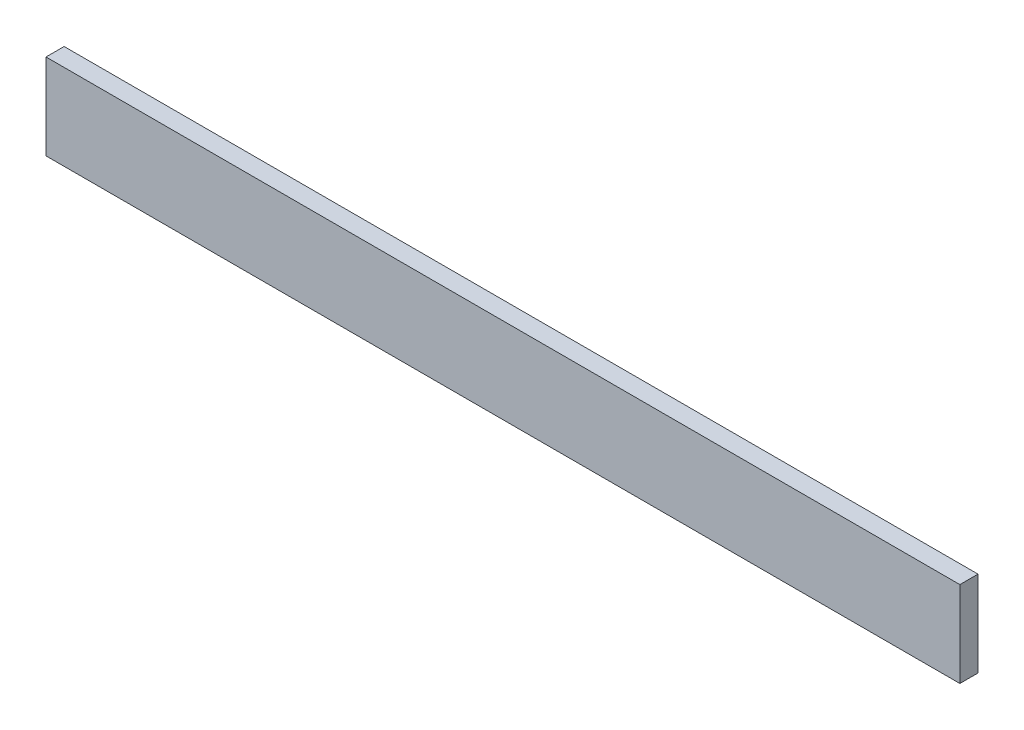
ISO-10303-21;
HEADER;
FILE_DESCRIPTION(('STEP AP214'),'2;1');
FILE_NAME('part.step','',(''),(''),'','','');
FILE_SCHEMA(('AUTOMOTIVE_DESIGN { 1 0 10303 214 1 1 1 1 }'));
ENDSEC;
DATA;
#1=APPLICATION_CONTEXT('core data for automotive mechanical design processes');
#2=APPLICATION_PROTOCOL_DEFINITION('international standard','automotive_design',2000,#1);
#3=PRODUCT_CONTEXT('',#1,'mechanical');
#4=PRODUCT('Part','Part','',(#3));
#5=PRODUCT_RELATED_PRODUCT_CATEGORY('part','',(#4));
#6=PRODUCT_DEFINITION_FORMATION('','',#4);
#7=PRODUCT_DEFINITION_CONTEXT('part definition',#1,'design');
#8=PRODUCT_DEFINITION('design','',#6,#7);
#9=PRODUCT_DEFINITION_SHAPE('','',#8);
#10=(LENGTH_UNIT() NAMED_UNIT(*) SI_UNIT(.MILLI.,.METRE.));
#11=(NAMED_UNIT(*) PLANE_ANGLE_UNIT() SI_UNIT($,.RADIAN.));
#12=(NAMED_UNIT(*) SI_UNIT($,.STERADIAN.) SOLID_ANGLE_UNIT());
#13=UNCERTAINTY_MEASURE_WITH_UNIT(LENGTH_MEASURE(1.E-05),#10,'distance_accuracy_value','');
#14=(GEOMETRIC_REPRESENTATION_CONTEXT(3) GLOBAL_UNCERTAINTY_ASSIGNED_CONTEXT((#13)) GLOBAL_UNIT_ASSIGNED_CONTEXT((#10,
#11,#12)) REPRESENTATION_CONTEXT('',''));
#15=CARTESIAN_POINT('',(0.,0.,0.));
#16=DIRECTION('',(0.,0.,1.));
#17=DIRECTION('',(1.,0.,0.));
#18=AXIS2_PLACEMENT_3D('',#15,#16,#17);
#19=CARTESIAN_POINT('',(80.,7.5,3.175));
#20=DIRECTION('',(-1.,0.,0.));
#21=DIRECTION('',(0.,0.,1.));
#22=AXIS2_PLACEMENT_3D('',#19,#20,#21);
#23=PLANE('',#22);
#24=DIRECTION('',(0.,1.,0.));
#25=VECTOR('',#24,1.);
#26=CARTESIAN_POINT('',(80.,7.5,0.));
#27=LINE('',#26,#25);
#28=CARTESIAN_POINT('',(80.,-7.5,0.));
#29=VERTEX_POINT('',#28);
#30=CARTESIAN_POINT('',(80.,7.5,0.));
#31=VERTEX_POINT('',#30);
#32=EDGE_CURVE('E100',#29,#31,#27,.T.);
#33=ORIENTED_EDGE('',*,*,#32,.T.);
#34=DIRECTION('',(0.,0.,-1.));
#35=VECTOR('',#34,1.);
#36=CARTESIAN_POINT('',(80.,7.5,3.175));
#37=LINE('',#36,#35);
#38=CARTESIAN_POINT('',(80.,7.5,3.175));
#39=VERTEX_POINT('',#38);
#40=EDGE_CURVE('E11',#39,#31,#37,.T.);
#41=ORIENTED_EDGE('',*,*,#40,.F.);
#42=DIRECTION('',(0.,1.,0.));
#43=VECTOR('',#42,1.);
#44=CARTESIAN_POINT('',(80.,7.5,3.175));
#45=LINE('',#44,#43);
#46=CARTESIAN_POINT('',(80.,-7.5,3.175));
#47=VERTEX_POINT('',#46);
#48=EDGE_CURVE('E88',#47,#39,#45,.T.);
#49=ORIENTED_EDGE('',*,*,#48,.F.);
#50=DIRECTION('',(0.,0.,-1.));
#51=VECTOR('',#50,1.);
#52=CARTESIAN_POINT('',(80.,-7.5,3.175));
#53=LINE('',#52,#51);
#54=EDGE_CURVE('E96',#47,#29,#53,.T.);
#55=ORIENTED_EDGE('',*,*,#54,.T.);
#56=EDGE_LOOP('',(#33,#41,#49,#55));
#57=FACE_BOUND('',#56,.T.);
#58=ADVANCED_FACE('F37',(#57),#23,.F.);
#59=CARTESIAN_POINT('',(-80.,7.5,3.175));
#60=DIRECTION('',(0.,-1.,0.));
#61=DIRECTION('',(0.,0.,-1.));
#62=AXIS2_PLACEMENT_3D('',#59,#60,#61);
#63=PLANE('',#62);
#64=DIRECTION('',(-1.,0.,0.));
#65=VECTOR('',#64,1.);
#66=CARTESIAN_POINT('',(-80.,7.5,0.));
#67=LINE('',#66,#65);
#68=CARTESIAN_POINT('',(-80.,7.5,0.));
#69=VERTEX_POINT('',#68);
#70=EDGE_CURVE('E92',#31,#69,#67,.T.);
#71=ORIENTED_EDGE('',*,*,#70,.T.);
#72=DIRECTION('',(0.,0.,-1.));
#73=VECTOR('',#72,1.);
#74=CARTESIAN_POINT('',(-80.,7.5,3.175));
#75=LINE('',#74,#73);
#76=CARTESIAN_POINT('',(-80.,7.5,3.175));
#77=VERTEX_POINT('',#76);
#78=EDGE_CURVE('E45',#77,#69,#75,.T.);
#79=ORIENTED_EDGE('',*,*,#78,.F.);
#80=DIRECTION('',(-1.,0.,0.));
#81=VECTOR('',#80,1.);
#82=CARTESIAN_POINT('',(-80.,7.5,3.175));
#83=LINE('',#82,#81);
#84=EDGE_CURVE('E83',#39,#77,#83,.T.);
#85=ORIENTED_EDGE('',*,*,#84,.F.);
#86=ORIENTED_EDGE('',*,*,#40,.T.);
#87=EDGE_LOOP('',(#71,#79,#85,#86));
#88=FACE_BOUND('',#87,.T.);
#89=ADVANCED_FACE('F91',(#88),#63,.F.);
#90=CARTESIAN_POINT('',(-80.,7.5,3.175));
#91=DIRECTION('',(1.,0.,0.));
#92=DIRECTION('',(0.,0.,-1.));
#93=AXIS2_PLACEMENT_3D('',#90,#91,#92);
#94=PLANE('',#93);
#95=DIRECTION('',(0.,-1.,0.));
#96=VECTOR('',#95,1.);
#97=CARTESIAN_POINT('',(-80.,7.5,0.));
#98=LINE('',#97,#96);
#99=CARTESIAN_POINT('',(-80.,-7.5,0.));
#100=VERTEX_POINT('',#99);
#101=EDGE_CURVE('E70',#69,#100,#98,.T.);
#102=ORIENTED_EDGE('',*,*,#101,.T.);
#103=DIRECTION('',(0.,0.,-1.));
#104=VECTOR('',#103,1.);
#105=CARTESIAN_POINT('',(-80.,-7.5,3.175));
#106=LINE('',#105,#104);
#107=CARTESIAN_POINT('',(-80.,-7.5,3.175));
#108=VERTEX_POINT('',#107);
#109=EDGE_CURVE('E93',#108,#100,#106,.T.);
#110=ORIENTED_EDGE('',*,*,#109,.F.);
#111=DIRECTION('',(0.,-1.,0.));
#112=VECTOR('',#111,1.);
#113=CARTESIAN_POINT('',(-80.,7.5,3.175));
#114=LINE('',#113,#112);
#115=EDGE_CURVE('E86',#77,#108,#114,.T.);
#116=ORIENTED_EDGE('',*,*,#115,.F.);
#117=ORIENTED_EDGE('',*,*,#78,.T.);
#118=EDGE_LOOP('',(#102,#110,#116,#117));
#119=FACE_BOUND('',#118,.T.);
#120=ADVANCED_FACE('F94',(#119),#94,.F.);
#121=CARTESIAN_POINT('',(-80.,-7.5,3.175));
#122=DIRECTION('',(0.,1.,0.));
#123=DIRECTION('',(0.,0.,1.));
#124=AXIS2_PLACEMENT_3D('',#121,#122,#123);
#125=PLANE('',#124);
#126=DIRECTION('',(1.,0.,0.));
#127=VECTOR('',#126,1.);
#128=CARTESIAN_POINT('',(-80.,-7.5,0.));
#129=LINE('',#128,#127);
#130=EDGE_CURVE('E76',#100,#29,#129,.T.);
#131=ORIENTED_EDGE('',*,*,#130,.T.);
#132=ORIENTED_EDGE('',*,*,#54,.F.);
#133=DIRECTION('',(1.,0.,0.));
#134=VECTOR('',#133,1.);
#135=CARTESIAN_POINT('',(-80.,-7.5,3.175));
#136=LINE('',#135,#134);
#137=EDGE_CURVE('E53',#108,#47,#136,.T.);
#138=ORIENTED_EDGE('',*,*,#137,.F.);
#139=ORIENTED_EDGE('',*,*,#109,.T.);
#140=EDGE_LOOP('',(#131,#132,#138,#139));
#141=FACE_BOUND('',#140,.T.);
#142=ADVANCED_FACE('F107',(#141),#125,.F.);
#143=CARTESIAN_POINT('',(0.,0.,3.175));
#144=DIRECTION('',(0.,0.,1.));
#145=DIRECTION('',(1.,0.,0.));
#146=AXIS2_PLACEMENT_3D('',#143,#144,#145);
#147=PLANE('',#146);
#148=ORIENTED_EDGE('',*,*,#48,.T.);
#149=ORIENTED_EDGE('',*,*,#84,.T.);
#150=ORIENTED_EDGE('',*,*,#115,.T.);
#151=ORIENTED_EDGE('',*,*,#137,.T.);
#152=EDGE_LOOP('',(#148,#149,#150,#151));
#153=FACE_BOUND('',#152,.T.);
#154=ADVANCED_FACE('F84',(#153),#147,.T.);
#155=CARTESIAN_POINT('',(0.,0.,0.));
#156=DIRECTION('',(0.,0.,1.));
#157=DIRECTION('',(1.,0.,0.));
#158=AXIS2_PLACEMENT_3D('',#155,#156,#157);
#159=PLANE('',#158);
#160=ORIENTED_EDGE('',*,*,#32,.F.);
#161=ORIENTED_EDGE('',*,*,#130,.F.);
#162=ORIENTED_EDGE('',*,*,#101,.F.);
#163=ORIENTED_EDGE('',*,*,#70,.F.);
#164=EDGE_LOOP('',(#160,#161,#162,#163));
#165=FACE_BOUND('',#164,.T.);
#166=ADVANCED_FACE('F110',(#165),#159,.F.);
#167=CLOSED_SHELL('',(#58,#89,#120,#142,#154,#166));
#168=MANIFOLD_SOLID_BREP('B2',#167);
#169=ADVANCED_BREP_SHAPE_REPRESENTATION('',(#18,#168),#14);
#170=SHAPE_DEFINITION_REPRESENTATION(#9,#169);
ENDSEC;
END-ISO-10303-21;
